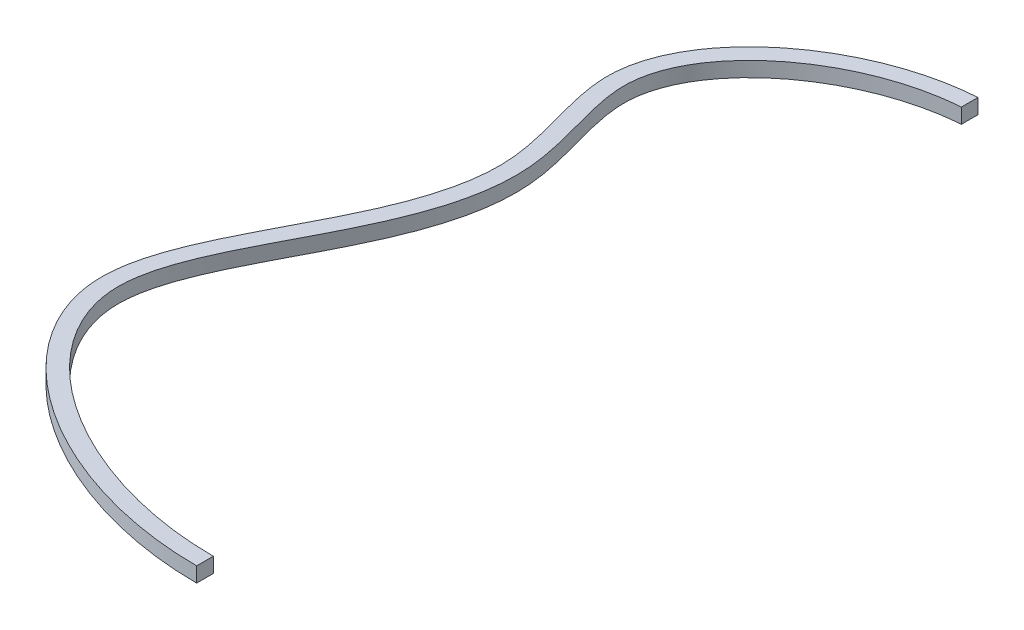
ISO-10303-21;
HEADER;
FILE_DESCRIPTION(('STEP AP214'),'2;1');
FILE_NAME('part.step','',(''),(''),'','','');
FILE_SCHEMA(('AUTOMOTIVE_DESIGN { 1 0 10303 214 1 1 1 1 }'));
ENDSEC;
DATA;
#1=APPLICATION_CONTEXT('core data for automotive mechanical design processes');
#2=APPLICATION_PROTOCOL_DEFINITION('international standard','automotive_design',2000,#1);
#3=PRODUCT_CONTEXT('',#1,'mechanical');
#4=PRODUCT('Part','Part','',(#3));
#5=PRODUCT_RELATED_PRODUCT_CATEGORY('part','',(#4));
#6=PRODUCT_DEFINITION_FORMATION('','',#4);
#7=PRODUCT_DEFINITION_CONTEXT('part definition',#1,'design');
#8=PRODUCT_DEFINITION('design','',#6,#7);
#9=PRODUCT_DEFINITION_SHAPE('','',#8);
#10=(LENGTH_UNIT() NAMED_UNIT(*) SI_UNIT(.MILLI.,.METRE.));
#11=(NAMED_UNIT(*) PLANE_ANGLE_UNIT() SI_UNIT($,.RADIAN.));
#12=(NAMED_UNIT(*) SI_UNIT($,.STERADIAN.) SOLID_ANGLE_UNIT());
#13=UNCERTAINTY_MEASURE_WITH_UNIT(LENGTH_MEASURE(1.E-05),#10,'distance_accuracy_value','');
#14=(GEOMETRIC_REPRESENTATION_CONTEXT(3) GLOBAL_UNCERTAINTY_ASSIGNED_CONTEXT((#13)) GLOBAL_UNIT_ASSIGNED_CONTEXT((#10,
#11,#12)) REPRESENTATION_CONTEXT('',''));
#15=CARTESIAN_POINT('',(0.,0.,0.));
#16=DIRECTION('',(0.,0.,1.));
#17=DIRECTION('',(1.,0.,0.));
#18=AXIS2_PLACEMENT_3D('',#15,#16,#17);
#19=CARTESIAN_POINT('',(-1.8191065108785E-09,-9.,229.5));
#20=DIRECTION('',(-1.,0.,-9.28535410600059E-12));
#21=DIRECTION('',(-9.28535410600059E-12,0.,1.));
#22=AXIS2_PLACEMENT_3D('',#19,#20,#21);
#23=PLANE('',#22);
#24=DIRECTION('',(-9.28535410600059E-12,0.,1.));
#25=VECTOR('',#24,1.);
#26=CARTESIAN_POINT('',(-1.8191065108785E-09,0.,229.5));
#27=LINE('',#26,#25);
#28=CARTESIAN_POINT('',(-1.8191065108785E-09,0.,229.5));
#29=VERTEX_POINT('',#28);
#30=CARTESIAN_POINT('',(-1.91196005193851E-09,0.,239.5));
#31=VERTEX_POINT('',#30);
#32=EDGE_CURVE('E70',#29,#31,#27,.T.);
#33=ORIENTED_EDGE('',*,*,#32,.T.);
#34=DIRECTION('',(0.,1.,0.));
#35=VECTOR('',#34,1.);
#36=CARTESIAN_POINT('',(-1.91196005193851E-09,-9.,239.5));
#37=LINE('',#36,#35);
#38=CARTESIAN_POINT('',(-1.91196005193851E-09,-9.,239.5));
#39=VERTEX_POINT('',#38);
#40=EDGE_CURVE('E41',#39,#31,#37,.T.);
#41=ORIENTED_EDGE('',*,*,#40,.F.);
#42=DIRECTION('',(-9.28535410600059E-12,0.,1.));
#43=VECTOR('',#42,1.);
#44=CARTESIAN_POINT('',(-1.8191065108785E-09,-9.,229.5));
#45=LINE('',#44,#43);
#46=CARTESIAN_POINT('',(-1.8191065108785E-09,-9.,229.5));
#47=VERTEX_POINT('',#46);
#48=EDGE_CURVE('E72',#47,#39,#45,.T.);
#49=ORIENTED_EDGE('',*,*,#48,.F.);
#50=DIRECTION('',(0.,1.,0.));
#51=VECTOR('',#50,1.);
#52=CARTESIAN_POINT('',(-1.8191065108785E-09,-9.,229.5));
#53=LINE('',#52,#51);
#54=EDGE_CURVE('E56',#47,#29,#53,.T.);
#55=ORIENTED_EDGE('',*,*,#54,.T.);
#56=EDGE_LOOP('',(#33,#41,#49,#55));
#57=FACE_BOUND('',#56,.T.);
#58=ADVANCED_FACE('F34',(#57),#23,.F.);
#59=CARTESIAN_POINT('',(-1.91196005193851E-09,-9.,239.5));
#60=CARTESIAN_POINT('',(-8.3109760610315,-9.,239.499999999923));
#61=CARTESIAN_POINT('',(-24.9561899599744,-9.,238.492983024372));
#62=CARTESIAN_POINT('',(-57.7134237608047,-9.,232.772987594002));
#63=CARTESIAN_POINT('',(-96.5522933644871,-9.,219.292646162081));
#64=CARTESIAN_POINT('',(-129.569918210259,-9.,199.101969248122));
#65=CARTESIAN_POINT('',(-150.708350804758,-9.,180.045027056367));
#66=CARTESIAN_POINT('',(-163.495475276045,-9.,164.603018101248));
#67=CARTESIAN_POINT('',(-172.814469787903,-9.,148.32058522376));
#68=CARTESIAN_POINT('',(-177.394797822022,-9.,134.299930543541));
#69=CARTESIAN_POINT('',(-178.999895268025,-9.,122.916746132812));
#70=CARTESIAN_POINT('',(-179.158967679136,-9.,111.44694472181));
#71=CARTESIAN_POINT('',(-176.76109794714,-9.,96.6408371755662));
#72=CARTESIAN_POINT('',(-170.559838176356,-9.,78.1832975133415));
#73=CARTESIAN_POINT('',(-161.946233836959,-9.,59.1549803113952));
#74=CARTESIAN_POINT('',(-151.913539915864,-9.,39.6571666474841));
#75=CARTESIAN_POINT('',(-141.475748102104,-9.,19.7489861427809));
#76=CARTESIAN_POINT('',(-131.656735815428,-9.,-0.545967446423489));
#77=CARTESIAN_POINT('',(-123.494469890395,-9.,-21.2352496824963));
#78=CARTESIAN_POINT('',(-118.963872332156,-9.,-38.834806185247));
#79=CARTESIAN_POINT('',(-117.278607971138,-9.,-53.1285246434968));
#80=CARTESIAN_POINT('',(-117.120496720986,-9.,-63.9535796331771));
#81=CARTESIAN_POINT('',(-118.27055869258,-9.,-74.8231778910401));
#82=CARTESIAN_POINT('',(-121.117244049144,-9.,-89.006717584416));
#83=CARTESIAN_POINT('',(-126.030149296236,-9.,-106.295777052502));
#84=CARTESIAN_POINT('',(-130.174661884326,-9.,-122.881768352475));
#85=CARTESIAN_POINT('',(-131.629460913158,-9.,-135.574472390588));
#86=CARTESIAN_POINT('',(-131.451280813219,-9.,-144.768018940345));
#87=CARTESIAN_POINT('',(-129.924637368863,-9.,-153.900566078835));
#88=CARTESIAN_POINT('',(-126.22271081223,-9.,-165.88812368307));
#89=CARTESIAN_POINT('',(-118.608751315216,-9.,-180.417659607352));
#90=CARTESIAN_POINT('',(-105.274030485468,-9.,-196.59994779526));
#91=CARTESIAN_POINT('',(-88.4026033537905,-9.,-210.977320691338));
#92=CARTESIAN_POINT('',(-68.7043775970016,-9.,-223.018299697672));
#93=CARTESIAN_POINT('',(-46.9110516698991,-9.,-232.218330564944));
#94=CARTESIAN_POINT('',(-23.755360969542,-9.,-238.097668482205));
#95=CARTESIAN_POINT('',(-7.91377812006415,-9.,-239.5));
#96=CARTESIAN_POINT('',(0.,-9.,-239.5));
#97=B_SPLINE_CURVE_WITH_KNOTS('',3,(#59,#60,#61,#62,#63,#64,#65,#66,#67,#68,#69,#70,#71,#72,#73,
#74,#75,#76,#77,#78,#79,#80,#81,#82,#83,#84,#85,#86,#87,#88,#89,#90,#91,#92,#93,#94,#95,#96),
.UNSPECIFIED.,.F.,.F.,(4,1,1,1,1,1,1,1,1,1,1,1,1,1,1,1,1,1,1,1,1,1,1,1,1,1,1,1,1,1,1,1,1,1,1,4),
(0.5,0.515625,0.53125,0.5625,0.59375,0.609375,0.625,0.640625,0.65625,0.6640625,0.671875,0.6875,
0.703125,0.71875,0.734375,0.75,0.765625,0.78125,0.796875,0.8046875,0.8125,0.8203125,0.828125,
0.84375,0.859375,0.8671875,0.875,0.8828125,0.890625,0.90625,0.921875,0.9375,0.953125,0.96875,
0.984375,1.),.UNSPECIFIED.);
#98=DIRECTION('',(0.,1.,0.));
#99=VECTOR('',#98,1.);
#100=SURFACE_OF_LINEAR_EXTRUSION('',#97,#99);
#101=CARTESIAN_POINT('',(-1.91196005193851E-09,0.,239.5));
#102=CARTESIAN_POINT('',(-8.3109760610315,0.,239.499999999923));
#103=CARTESIAN_POINT('',(-24.9561899599744,0.,238.492983024372));
#104=CARTESIAN_POINT('',(-57.7134237608047,0.,232.772987594002));
#105=CARTESIAN_POINT('',(-96.5522933644871,0.,219.292646162081));
#106=CARTESIAN_POINT('',(-129.569918210259,0.,199.101969248122));
#107=CARTESIAN_POINT('',(-150.708350804758,0.,180.045027056367));
#108=CARTESIAN_POINT('',(-163.495475276045,0.,164.603018101248));
#109=CARTESIAN_POINT('',(-172.814469787903,0.,148.32058522376));
#110=CARTESIAN_POINT('',(-177.394797822022,0.,134.299930543541));
#111=CARTESIAN_POINT('',(-178.999895268025,0.,122.916746132812));
#112=CARTESIAN_POINT('',(-179.158967679136,0.,111.44694472181));
#113=CARTESIAN_POINT('',(-176.76109794714,0.,96.6408371755662));
#114=CARTESIAN_POINT('',(-170.559838176356,0.,78.1832975133415));
#115=CARTESIAN_POINT('',(-161.946233836959,0.,59.1549803113952));
#116=CARTESIAN_POINT('',(-151.913539915864,0.,39.6571666474841));
#117=CARTESIAN_POINT('',(-141.475748102104,0.,19.7489861427809));
#118=CARTESIAN_POINT('',(-131.656735815428,0.,-0.545967446423489));
#119=CARTESIAN_POINT('',(-123.494469890395,0.,-21.2352496824963));
#120=CARTESIAN_POINT('',(-118.963872332156,0.,-38.834806185247));
#121=CARTESIAN_POINT('',(-117.278607971138,0.,-53.1285246434968));
#122=CARTESIAN_POINT('',(-117.120496720986,0.,-63.9535796331771));
#123=CARTESIAN_POINT('',(-118.27055869258,0.,-74.8231778910401));
#124=CARTESIAN_POINT('',(-121.117244049144,0.,-89.006717584416));
#125=CARTESIAN_POINT('',(-126.030149296236,0.,-106.295777052502));
#126=CARTESIAN_POINT('',(-130.174661884326,0.,-122.881768352475));
#127=CARTESIAN_POINT('',(-131.629460913158,0.,-135.574472390588));
#128=CARTESIAN_POINT('',(-131.451280813219,0.,-144.768018940345));
#129=CARTESIAN_POINT('',(-129.924637368863,0.,-153.900566078835));
#130=CARTESIAN_POINT('',(-126.22271081223,0.,-165.88812368307));
#131=CARTESIAN_POINT('',(-118.608751315216,0.,-180.417659607352));
#132=CARTESIAN_POINT('',(-105.274030485468,0.,-196.59994779526));
#133=CARTESIAN_POINT('',(-88.4026033537905,0.,-210.977320691338));
#134=CARTESIAN_POINT('',(-68.7043775970016,0.,-223.018299697672));
#135=CARTESIAN_POINT('',(-46.9110516698991,0.,-232.218330564944));
#136=CARTESIAN_POINT('',(-23.755360969542,0.,-238.097668482205));
#137=CARTESIAN_POINT('',(-7.91377812006415,0.,-239.5));
#138=CARTESIAN_POINT('',(0.,0.,-239.5));
#139=B_SPLINE_CURVE_WITH_KNOTS('',3,(#101,#102,#103,#104,#105,#106,#107,#108,#109,#110,#111,
#112,#113,#114,#115,#116,#117,#118,#119,#120,#121,#122,#123,#124,#125,#126,#127,#128,#129,#130,
#131,#132,#133,#134,#135,#136,#137,#138),.UNSPECIFIED.,.F.,.F.,(4,1,1,1,1,1,1,1,1,1,1,1,1,1,1,1,
1,1,1,1,1,1,1,1,1,1,1,1,1,1,1,1,1,1,1,4),(0.5,0.515625,0.53125,0.5625,0.59375,0.609375,0.625,
0.640625,0.65625,0.6640625,0.671875,0.6875,0.703125,0.71875,0.734375,0.75,0.765625,0.78125,
0.796875,0.8046875,0.8125,0.8203125,0.828125,0.84375,0.859375,0.8671875,0.875,0.8828125,
0.890625,0.90625,0.921875,0.9375,0.953125,0.96875,0.984375,1.),.UNSPECIFIED.);
#140=CARTESIAN_POINT('',(-8.99999998054999,0.,-239.201440452037));
#141=VERTEX_POINT('',#140);
#142=EDGE_CURVE('E82',#31,#141,#139,.T.);
#143=ORIENTED_EDGE('',*,*,#142,.T.);
#144=DIRECTION('',(0.,1.,0.));
#145=VECTOR('',#144,1.);
#146=CARTESIAN_POINT('',(-9.00000000000001,-9.,-239.201440450754));
#147=LINE('',#146,#145);
#148=CARTESIAN_POINT('',(-9.00000000000001,-9.,-239.201440450754));
#149=VERTEX_POINT('',#148);
#150=EDGE_CURVE('E47',#141,#149,#147,.F.);
#151=ORIENTED_EDGE('',*,*,#150,.T.);
#152=EDGE_CURVE('E91',#39,#149,#97,.T.);
#153=ORIENTED_EDGE('',*,*,#152,.F.);
#154=ORIENTED_EDGE('',*,*,#40,.T.);
#155=EDGE_LOOP('',(#143,#151,#153,#154));
#156=FACE_BOUND('',#155,.T.);
#157=ADVANCED_FACE('F102',(#156),#100,.F.);
#158=CARTESIAN_POINT('',(-1.8191065108785E-09,-9.,229.5));
#159=CARTESIAN_POINT('',(-15.8190057659245,-9.,229.499999999853));
#160=CARTESIAN_POINT('',(-47.6615294700858,-9.,225.658163660407));
#161=CARTESIAN_POINT('',(-92.3043519911291,-9.,210.159941942199));
#162=CARTESIAN_POINT('',(-123.710318532257,-9.,190.921787498291));
#163=CARTESIAN_POINT('',(-143.507479245258,-9.,173.056054468192));
#164=CARTESIAN_POINT('',(-155.280566666697,-9.,158.816660309665));
#165=CARTESIAN_POINT('',(-163.647391496235,-9.,144.152730377518));
#166=CARTESIAN_POINT('',(-167.630854276794,-9.,131.897037488354));
#167=CARTESIAN_POINT('',(-169.003214154582,-9.,122.131241801685));
#168=CARTESIAN_POINT('',(-169.142932057595,-9.,112.371587965205));
#169=CARTESIAN_POINT('',(-167.049798768938,-9.,99.1939781769793));
#170=CARTESIAN_POINT('',(-161.280596253734,-9.,81.9524115470428));
#171=CARTESIAN_POINT('',(-152.97503504001,-9.,63.5803062407656));
#172=CARTESIAN_POINT('',(-143.070602244401,-9.,44.3257365375459));
#173=CARTESIAN_POINT('',(-132.574359959243,-9.,24.3087463509652));
#174=CARTESIAN_POINT('',(-122.522515134722,-9.,3.5444419447904));
#175=CARTESIAN_POINT('',(-115.410608716852,-9.,-14.4514448062424));
#176=CARTESIAN_POINT('',(-111.073582695228,-9.,-29.3383362352144));
#177=CARTESIAN_POINT('',(-108.665045100865,-9.,-40.7627576272873));
#178=CARTESIAN_POINT('',(-107.282749719709,-9.,-52.4530926001842));
#179=CARTESIAN_POINT('',(-107.139208920907,-9.,-62.3817874505676));
#180=CARTESIAN_POINT('',(-107.738141433207,-9.,-70.4395501575238));
#181=CARTESIAN_POINT('',(-108.767186008226,-9.,-78.2883613342947));
#182=CARTESIAN_POINT('',(-110.663382343776,-9.,-87.7427727111215));
#183=CARTESIAN_POINT('',(-113.432224149325,-9.,-98.5457448743427));
#184=CARTESIAN_POINT('',(-116.268573105216,-9.,-108.830320864192));
#185=CARTESIAN_POINT('',(-118.791685583566,-9.,-118.574150349681));
#186=CARTESIAN_POINT('',(-120.663100701039,-9.,-127.708884264483));
#187=CARTESIAN_POINT('',(-121.614837280111,-9.,-136.146293663594));
#188=CARTESIAN_POINT('',(-121.459117975926,-9.,-143.807450703325));
#189=CARTESIAN_POINT('',(-120.169846328421,-9.,-151.570708131032));
#190=CARTESIAN_POINT('',(-116.983931672611,-9.,-161.901993827628));
#191=CARTESIAN_POINT('',(-110.272555919396,-9.,-174.769124568155));
#192=CARTESIAN_POINT('',(-98.1555421551189,-9.,-189.505126959743));
#193=CARTESIAN_POINT('',(-82.5405664241055,-9.,-202.825943109233));
#194=CARTESIAN_POINT('',(-64.1355324967286,-9.,-214.082245671065));
#195=CARTESIAN_POINT('',(-43.7072991032739,-9.,-222.705493939142));
#196=CARTESIAN_POINT('',(-25.6636632309486,-9.,-227.285134045107));
#197=CARTESIAN_POINT('',(-10.995651491961,-9.,-229.175608931953));
#198=CARTESIAN_POINT('',(-3.66934284350941,-9.,-229.5));
#199=CARTESIAN_POINT('',(0.,-9.,-229.5));
#200=B_SPLINE_CURVE_WITH_KNOTS('',3,(#158,#159,#160,#161,#162,#163,#164,#165,#166,#167,#168,
#169,#170,#171,#172,#173,#174,#175,#176,#177,#178,#179,#180,#181,#182,#183,#184,#185,#186,#187,
#188,#189,#190,#191,#192,#193,#194,#195,#196,#197,#198,#199),.UNSPECIFIED.,.F.,.F.,(4,1,1,1,1,1,
1,1,1,1,1,1,1,1,1,1,1,1,1,1,1,1,1,1,1,1,1,1,1,1,1,1,1,1,1,1,1,1,1,4),(0.5,0.53125,0.5625,
0.59375,0.609375,0.625,0.640625,0.65625,0.6640625,0.671875,0.6875,0.703125,0.71875,0.734375,
0.75,0.765625,0.78125,0.7890625,0.796875,0.8046875,0.8125,0.81640625,0.8203125,0.828125,
0.8359375,0.84375,0.8515625,0.859375,0.8671875,0.875,0.8828125,0.890625,0.90625,0.921875,0.9375,
0.953125,0.96875,0.984375,0.9921875,1.),.UNSPECIFIED.);
#201=DIRECTION('',(0.,1.,0.));
#202=VECTOR('',#201,1.);
#203=SURFACE_OF_LINEAR_EXTRUSION('',#200,#202);
#204=DIRECTION('',(0.,1.,0.));
#205=VECTOR('',#204,1.);
#206=CARTESIAN_POINT('',(-9.00000000000008,-9.,-229.177992887165));
#207=LINE('',#206,#205);
#208=CARTESIAN_POINT('',(-9.00000000000001,0.,-229.177992888552));
#209=VERTEX_POINT('',#208);
#210=CARTESIAN_POINT('',(-9.00000000000008,-9.,-229.177992887165));
#211=VERTEX_POINT('',#210);
#212=EDGE_CURVE('E89',#209,#211,#207,.F.);
#213=ORIENTED_EDGE('',*,*,#212,.F.);
#214=CARTESIAN_POINT('',(-1.8191065108785E-09,0.,229.5));
#215=CARTESIAN_POINT('',(-15.8190057659245,0.,229.499999999853));
#216=CARTESIAN_POINT('',(-47.6615294700858,0.,225.658163660407));
#217=CARTESIAN_POINT('',(-92.3043519911291,0.,210.159941942199));
#218=CARTESIAN_POINT('',(-123.710318532257,0.,190.921787498291));
#219=CARTESIAN_POINT('',(-143.507479245258,0.,173.056054468192));
#220=CARTESIAN_POINT('',(-155.280566666697,0.,158.816660309665));
#221=CARTESIAN_POINT('',(-163.647391496235,0.,144.152730377518));
#222=CARTESIAN_POINT('',(-167.630854276794,0.,131.897037488354));
#223=CARTESIAN_POINT('',(-169.003214154582,0.,122.131241801685));
#224=CARTESIAN_POINT('',(-169.142932057595,0.,112.371587965205));
#225=CARTESIAN_POINT('',(-167.049798768938,0.,99.1939781769793));
#226=CARTESIAN_POINT('',(-161.280596253734,0.,81.9524115470428));
#227=CARTESIAN_POINT('',(-152.97503504001,0.,63.5803062407656));
#228=CARTESIAN_POINT('',(-143.070602244401,0.,44.3257365375459));
#229=CARTESIAN_POINT('',(-132.574359959243,0.,24.3087463509652));
#230=CARTESIAN_POINT('',(-122.522515134722,0.,3.5444419447904));
#231=CARTESIAN_POINT('',(-115.410608716852,0.,-14.4514448062424));
#232=CARTESIAN_POINT('',(-111.073582695228,0.,-29.3383362352144));
#233=CARTESIAN_POINT('',(-108.665045100865,0.,-40.7627576272873));
#234=CARTESIAN_POINT('',(-107.282749719709,0.,-52.4530926001842));
#235=CARTESIAN_POINT('',(-107.139208920907,0.,-62.3817874505676));
#236=CARTESIAN_POINT('',(-107.738141433207,0.,-70.4395501575238));
#237=CARTESIAN_POINT('',(-108.767186008226,0.,-78.2883613342947));
#238=CARTESIAN_POINT('',(-110.663382343776,0.,-87.7427727111215));
#239=CARTESIAN_POINT('',(-113.432224149325,0.,-98.5457448743427));
#240=CARTESIAN_POINT('',(-116.268573105216,0.,-108.830320864192));
#241=CARTESIAN_POINT('',(-118.791685583566,0.,-118.574150349681));
#242=CARTESIAN_POINT('',(-120.663100701039,0.,-127.708884264483));
#243=CARTESIAN_POINT('',(-121.614837280111,0.,-136.146293663594));
#244=CARTESIAN_POINT('',(-121.459117975926,0.,-143.807450703325));
#245=CARTESIAN_POINT('',(-120.169846328421,0.,-151.570708131032));
#246=CARTESIAN_POINT('',(-116.983931672611,0.,-161.901993827628));
#247=CARTESIAN_POINT('',(-110.272555919396,0.,-174.769124568155));
#248=CARTESIAN_POINT('',(-98.1555421551189,0.,-189.505126959743));
#249=CARTESIAN_POINT('',(-82.5405664241055,0.,-202.825943109233));
#250=CARTESIAN_POINT('',(-64.1355324967286,0.,-214.082245671065));
#251=CARTESIAN_POINT('',(-43.7072991032739,0.,-222.705493939142));
#252=CARTESIAN_POINT('',(-25.6636632309486,0.,-227.285134045107));
#253=CARTESIAN_POINT('',(-10.995651491961,0.,-229.175608931953));
#254=CARTESIAN_POINT('',(-3.66934284350941,0.,-229.5));
#255=CARTESIAN_POINT('',(0.,0.,-229.5));
#256=B_SPLINE_CURVE_WITH_KNOTS('',3,(#214,#215,#216,#217,#218,#219,#220,#221,#222,#223,#224,
#225,#226,#227,#228,#229,#230,#231,#232,#233,#234,#235,#236,#237,#238,#239,#240,#241,#242,#243,
#244,#245,#246,#247,#248,#249,#250,#251,#252,#253,#254,#255),.UNSPECIFIED.,.F.,.F.,(4,1,1,1,1,1,
1,1,1,1,1,1,1,1,1,1,1,1,1,1,1,1,1,1,1,1,1,1,1,1,1,1,1,1,1,1,1,1,1,4),(0.5,0.53125,0.5625,
0.59375,0.609375,0.625,0.640625,0.65625,0.6640625,0.671875,0.6875,0.703125,0.71875,0.734375,
0.75,0.765625,0.78125,0.7890625,0.796875,0.8046875,0.8125,0.81640625,0.8203125,0.828125,
0.8359375,0.84375,0.8515625,0.859375,0.8671875,0.875,0.8828125,0.890625,0.90625,0.921875,0.9375,
0.953125,0.96875,0.984375,0.9921875,1.),.UNSPECIFIED.);
#257=EDGE_CURVE('E80',#29,#209,#256,.T.);
#258=ORIENTED_EDGE('',*,*,#257,.F.);
#259=ORIENTED_EDGE('',*,*,#54,.F.);
#260=EDGE_CURVE('E74',#47,#211,#200,.T.);
#261=ORIENTED_EDGE('',*,*,#260,.T.);
#262=EDGE_LOOP('',(#213,#258,#259,#261));
#263=FACE_BOUND('',#262,.T.);
#264=ADVANCED_FACE('F87',(#263),#203,.T.);
#265=CARTESIAN_POINT('',(-141.578878023285,-9.,19.6845239620307));
#266=DIRECTION('',(0.,1.,0.));
#267=DIRECTION('',(0.,0.,1.));
#268=AXIS2_PLACEMENT_3D('',#265,#266,#267);
#269=PLANE('',#268);
#270=ORIENTED_EDGE('',*,*,#152,.T.);
#271=DIRECTION('',(0.,0.,1.));
#272=VECTOR('',#271,1.);
#273=CARTESIAN_POINT('',(-9.00000000000001,-9.,19.6845239620307));
#274=LINE('',#273,#272);
#275=EDGE_CURVE('E84',#149,#211,#274,.T.);
#276=ORIENTED_EDGE('',*,*,#275,.T.);
#277=ORIENTED_EDGE('',*,*,#260,.F.);
#278=ORIENTED_EDGE('',*,*,#48,.T.);
#279=EDGE_LOOP('',(#270,#276,#277,#278));
#280=FACE_BOUND('',#279,.T.);
#281=ADVANCED_FACE('F107',(#280),#269,.F.);
#282=CARTESIAN_POINT('',(-141.578878023285,0.,19.6845239620307));
#283=DIRECTION('',(0.,1.,0.));
#284=DIRECTION('',(0.,0.,1.));
#285=AXIS2_PLACEMENT_3D('',#282,#283,#284);
#286=PLANE('',#285);
#287=DIRECTION('',(0.,0.,1.));
#288=VECTOR('',#287,1.);
#289=CARTESIAN_POINT('',(-9.00000000000001,0.,19.6845239620307));
#290=LINE('',#289,#288);
#291=EDGE_CURVE('E11',#141,#209,#290,.T.);
#292=ORIENTED_EDGE('',*,*,#291,.F.);
#293=ORIENTED_EDGE('',*,*,#142,.F.);
#294=ORIENTED_EDGE('',*,*,#32,.F.);
#295=ORIENTED_EDGE('',*,*,#257,.T.);
#296=EDGE_LOOP('',(#292,#293,#294,#295));
#297=FACE_BOUND('',#296,.T.);
#298=ADVANCED_FACE('F78',(#297),#286,.T.);
#299=CARTESIAN_POINT('',(-9.,5.,-220.5));
#300=DIRECTION('',(-1.,0.,0.));
#301=DIRECTION('',(0.,-1.,0.));
#302=AXIS2_PLACEMENT_3D('',#299,#300,#301);
#303=PLANE('',#302);
#304=ORIENTED_EDGE('',*,*,#150,.F.);
#305=ORIENTED_EDGE('',*,*,#291,.T.);
#306=ORIENTED_EDGE('',*,*,#212,.T.);
#307=ORIENTED_EDGE('',*,*,#275,.F.);
#308=EDGE_LOOP('',(#304,#305,#306,#307));
#309=FACE_BOUND('',#308,.T.);
#310=ADVANCED_FACE('F156',(#309),#303,.F.);
#311=CLOSED_SHELL('',(#58,#157,#264,#281,#298,#310));
#312=MANIFOLD_SOLID_BREP('B2',#311);
#313=ADVANCED_BREP_SHAPE_REPRESENTATION('',(#18,#312),#14);
#314=SHAPE_DEFINITION_REPRESENTATION(#9,#313);
ENDSEC;
END-ISO-10303-21;
